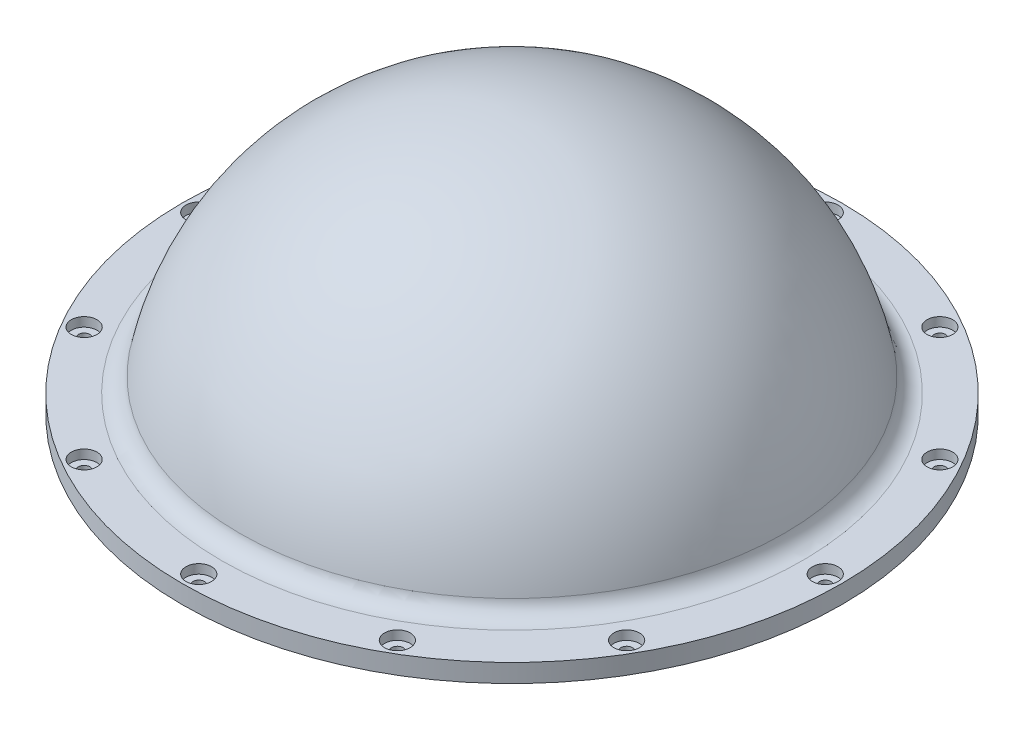
ISO-10303-21;
HEADER;
FILE_DESCRIPTION(('STEP AP214'),'2;1');
FILE_NAME('part.step','',(''),(''),'','','');
FILE_SCHEMA(('AUTOMOTIVE_DESIGN { 1 0 10303 214 1 1 1 1 }'));
ENDSEC;
DATA;
#1=APPLICATION_CONTEXT('core data for automotive mechanical design processes');
#2=APPLICATION_PROTOCOL_DEFINITION('international standard','automotive_design',2000,#1);
#3=PRODUCT_CONTEXT('',#1,'mechanical');
#4=PRODUCT('Part','Part','',(#3));
#5=PRODUCT_RELATED_PRODUCT_CATEGORY('part','',(#4));
#6=PRODUCT_DEFINITION_FORMATION('','',#4);
#7=PRODUCT_DEFINITION_CONTEXT('part definition',#1,'design');
#8=PRODUCT_DEFINITION('design','',#6,#7);
#9=PRODUCT_DEFINITION_SHAPE('','',#8);
#10=(LENGTH_UNIT() NAMED_UNIT(*) SI_UNIT(.MILLI.,.METRE.));
#11=(NAMED_UNIT(*) PLANE_ANGLE_UNIT() SI_UNIT($,.RADIAN.));
#12=(NAMED_UNIT(*) SI_UNIT($,.STERADIAN.) SOLID_ANGLE_UNIT());
#13=UNCERTAINTY_MEASURE_WITH_UNIT(LENGTH_MEASURE(1.E-05),#10,'distance_accuracy_value','');
#14=(GEOMETRIC_REPRESENTATION_CONTEXT(3) GLOBAL_UNCERTAINTY_ASSIGNED_CONTEXT((#13)) GLOBAL_UNIT_ASSIGNED_CONTEXT((#10,
#11,#12)) REPRESENTATION_CONTEXT('',''));
#15=CARTESIAN_POINT('',(0.,0.,0.));
#16=DIRECTION('',(0.,0.,1.));
#17=DIRECTION('',(1.,0.,0.));
#18=AXIS2_PLACEMENT_3D('',#15,#16,#17);
#19=CARTESIAN_POINT('',(0.,0.,0.));
#20=DIRECTION('',(0.,1.,0.));
#21=DIRECTION('',(0.,0.,1.));
#22=AXIS2_PLACEMENT_3D('',#19,#20,#21);
#23=PLANE('',#22);
#24=CARTESIAN_POINT('',(0.,0.,0.));
#25=DIRECTION('',(0.,1.,0.));
#26=DIRECTION('',(0.,0.,1.));
#27=AXIS2_PLACEMENT_3D('',#24,#25,#26);
#28=CIRCLE('',#27,79.2148975887743);
#29=CARTESIAN_POINT('',(0.,0.,79.2148975887743));
#30=VERTEX_POINT('',#29);
#31=EDGE_CURVE('E11',#30,#30,#28,.F.);
#32=ORIENTED_EDGE('',*,*,#31,.T.);
#33=EDGE_LOOP('',(#32));
#34=FACE_BOUND('',#33,.T.);
#35=CARTESIAN_POINT('',(0.,0.,0.));
#36=DIRECTION('',(0.,1.,0.));
#37=DIRECTION('',(0.,0.,1.));
#38=AXIS2_PLACEMENT_3D('',#35,#36,#37);
#39=CIRCLE('',#38,90.);
#40=CARTESIAN_POINT('',(0.,0.,90.));
#41=VERTEX_POINT('',#40);
#42=EDGE_CURVE('E132',#41,#41,#39,.T.);
#43=ORIENTED_EDGE('',*,*,#42,.T.);
#44=EDGE_LOOP('',(#43));
#45=FACE_BOUND('',#44,.T.);
#46=CARTESIAN_POINT('',(-74.0451720235685,0.,42.7499999999964));
#47=DIRECTION('',(0.,1.,0.));
#48=DIRECTION('',(0.,0.,1.));
#49=AXIS2_PLACEMENT_3D('',#46,#47,#48);
#50=CIRCLE('',#49,3.49999999999905);
#51=CARTESIAN_POINT('',(-74.0451720235685,0.,46.2499999999954));
#52=VERTEX_POINT('',#51);
#53=EDGE_CURVE('E177',#52,#52,#50,.T.);
#54=ORIENTED_EDGE('',*,*,#53,.F.);
#55=EDGE_LOOP('',(#54));
#56=FACE_BOUND('',#55,.T.);
#57=CARTESIAN_POINT('',(42.749999999998,0.,74.0451720235658));
#58=DIRECTION('',(0.,1.,0.));
#59=DIRECTION('',(0.,0.,1.));
#60=AXIS2_PLACEMENT_3D('',#57,#58,#59);
#61=CIRCLE('',#60,3.50000000000179);
#62=CARTESIAN_POINT('',(42.749999999998,0.,77.5451720235676));
#63=VERTEX_POINT('',#62);
#64=EDGE_CURVE('E258',#63,#63,#61,.T.);
#65=ORIENTED_EDGE('',*,*,#64,.F.);
#66=EDGE_LOOP('',(#65));
#67=FACE_BOUND('',#66,.T.);
#68=CARTESIAN_POINT('',(85.4999999999973,0.,-1.58509660689577E-12));
#69=DIRECTION('',(0.,1.,0.));
#70=DIRECTION('',(0.,0.,1.));
#71=AXIS2_PLACEMENT_3D('',#68,#69,#70);
#72=CIRCLE('',#71,3.50000000000258);
#73=CARTESIAN_POINT('',(85.4999999999973,0.,3.50000000000099));
#74=VERTEX_POINT('',#73);
#75=EDGE_CURVE('E265',#74,#74,#72,.T.);
#76=ORIENTED_EDGE('',*,*,#75,.F.);
#77=EDGE_LOOP('',(#76));
#78=FACE_BOUND('',#77,.T.);
#79=CARTESIAN_POINT('',(74.0451720235669,0.,42.7499999999973));
#80=DIRECTION('',(0.,1.,0.));
#81=DIRECTION('',(0.,0.,1.));
#82=AXIS2_PLACEMENT_3D('',#79,#80,#81);
#83=CIRCLE('',#82,3.50000000000244);
#84=CARTESIAN_POINT('',(74.0451720235669,0.,46.2499999999997));
#85=VERTEX_POINT('',#84);
#86=EDGE_CURVE('E274',#85,#85,#83,.T.);
#87=ORIENTED_EDGE('',*,*,#86,.F.);
#88=EDGE_LOOP('',(#87));
#89=FACE_BOUND('',#88,.T.);
#90=CARTESIAN_POINT('',(-74.045172023569,0.,-42.7500000000009));
#91=DIRECTION('',(0.,1.,0.));
#92=DIRECTION('',(0.,0.,1.));
#93=AXIS2_PLACEMENT_3D('',#90,#91,#92);
#94=CIRCLE('',#93,3.50000000000001);
#95=CARTESIAN_POINT('',(-74.045172023569,0.,-39.2500000000008));
#96=VERTEX_POINT('',#95);
#97=EDGE_CURVE('E204',#96,#96,#94,.T.);
#98=ORIENTED_EDGE('',*,*,#97,.F.);
#99=EDGE_LOOP('',(#98));
#100=FACE_BOUND('',#99,.T.);
#101=CARTESIAN_POINT('',(-1.07640985539968E-12,0.,85.4999999999958));
#102=DIRECTION('',(0.,1.,0.));
#103=DIRECTION('',(0.,0.,1.));
#104=AXIS2_PLACEMENT_3D('',#101,#102,#103);
#105=CIRCLE('',#104,3.50000000000078);
#106=CARTESIAN_POINT('',(-1.07640985539968E-12,0.,88.9999999999965));
#107=VERTEX_POINT('',#106);
#108=EDGE_CURVE('E212',#107,#107,#105,.T.);
#109=ORIENTED_EDGE('',*,*,#108,.F.);
#110=EDGE_LOOP('',(#109));
#111=FACE_BOUND('',#110,.T.);
#112=CARTESIAN_POINT('',(-42.7499999999999,0.,74.0451720235653));
#113=DIRECTION('',(0.,1.,0.));
#114=DIRECTION('',(0.,0.,1.));
#115=AXIS2_PLACEMENT_3D('',#112,#113,#114);
#116=CIRCLE('',#115,3.4999999999998);
#117=CARTESIAN_POINT('',(-42.7499999999999,0.,77.5451720235651));
#118=VERTEX_POINT('',#117);
#119=EDGE_CURVE('E186',#118,#118,#116,.T.);
#120=ORIENTED_EDGE('',*,*,#119,.F.);
#121=EDGE_LOOP('',(#120));
#122=FACE_BOUND('',#121,.T.);
#123=CARTESIAN_POINT('',(-85.4999999999984,0.,-2.65103573216274E-12));
#124=DIRECTION('',(0.,1.,0.));
#125=DIRECTION('',(0.,0.,1.));
#126=AXIS2_PLACEMENT_3D('',#123,#124,#125);
#127=CIRCLE('',#126,3.49999999999879);
#128=CARTESIAN_POINT('',(-85.4999999999984,0.,3.49999999999614));
#129=VERTEX_POINT('',#128);
#130=EDGE_CURVE('E194',#129,#129,#127,.T.);
#131=ORIENTED_EDGE('',*,*,#130,.F.);
#132=EDGE_LOOP('',(#131));
#133=FACE_BOUND('',#132,.T.);
#134=CARTESIAN_POINT('',(-42.749999999999,0.,-74.0451720235701));
#135=DIRECTION('',(0.,1.,0.));
#136=DIRECTION('',(0.,0.,1.));
#137=AXIS2_PLACEMENT_3D('',#134,#135,#136);
#138=CIRCLE('',#137,3.5);
#139=CARTESIAN_POINT('',(-42.749999999999,0.,-70.54517202357));
#140=VERTEX_POINT('',#139);
#141=EDGE_CURVE('E248',#140,#140,#138,.T.);
#142=ORIENTED_EDGE('',*,*,#141,.F.);
#143=EDGE_LOOP('',(#142));
#144=FACE_BOUND('',#143,.T.);
#145=CARTESIAN_POINT('',(0.,0.,-85.5));
#146=DIRECTION('',(0.,1.,0.));
#147=DIRECTION('',(0.,0.,1.));
#148=AXIS2_PLACEMENT_3D('',#145,#146,#147);
#149=CIRCLE('',#148,3.5);
#150=CARTESIAN_POINT('',(0.,0.,-82.));
#151=VERTEX_POINT('',#150);
#152=EDGE_CURVE('E239',#151,#151,#149,.T.);
#153=ORIENTED_EDGE('',*,*,#152,.F.);
#154=EDGE_LOOP('',(#153));
#155=FACE_BOUND('',#154,.T.);
#156=CARTESIAN_POINT('',(74.0451720235674,0.,-42.7500000000006));
#157=DIRECTION('',(0.,1.,0.));
#158=DIRECTION('',(0.,0.,1.));
#159=AXIS2_PLACEMENT_3D('',#156,#157,#158);
#160=CIRCLE('',#159,3.50000000000216);
#161=CARTESIAN_POINT('',(74.0451720235674,0.,-39.2499999999984));
#162=VERTEX_POINT('',#161);
#163=EDGE_CURVE('E230',#162,#162,#160,.T.);
#164=ORIENTED_EDGE('',*,*,#163,.F.);
#165=EDGE_LOOP('',(#164));
#166=FACE_BOUND('',#165,.T.);
#167=CARTESIAN_POINT('',(42.7500000000001,0.,-74.0451720235695));
#168=DIRECTION('',(0.,1.,0.));
#169=DIRECTION('',(0.,0.,1.));
#170=AXIS2_PLACEMENT_3D('',#167,#168,#169);
#171=CIRCLE('',#170,3.5);
#172=CARTESIAN_POINT('',(42.7500000000001,0.,-70.5451720235694));
#173=VERTEX_POINT('',#172);
#174=EDGE_CURVE('E222',#173,#173,#171,.T.);
#175=ORIENTED_EDGE('',*,*,#174,.F.);
#176=EDGE_LOOP('',(#175));
#177=FACE_BOUND('',#176,.T.);
#178=ADVANCED_FACE('F111',(#34,#45,#56,#67,#78,#89,#100,#111,#122,#133,#144,#155,#166,#177),#23,.T.);
#179=CARTESIAN_POINT('',(0.,0.,0.));
#180=DIRECTION('',(0.,1.,0.));
#181=DIRECTION('',(0.,0.,1.));
#182=AXIS2_PLACEMENT_3D('',#179,#180,#181);
#183=CIRCLE('',#182,71.5);
#184=CARTESIAN_POINT('',(0.,0.,71.5));
#185=VERTEX_POINT('',#184);
#186=EDGE_CURVE('E135',#185,#185,#183,.T.);
#187=ORIENTED_EDGE('',*,*,#186,.F.);
#188=EDGE_LOOP('',(#187));
#189=FACE_BOUND('',#188,.T.);
#190=CARTESIAN_POINT('',(0.,0.,0.));
#191=DIRECTION('',(0.,1.,0.));
#192=DIRECTION('',(0.,0.,1.));
#193=AXIS2_PLACEMENT_3D('',#190,#191,#192);
#194=CIRCLE('',#193,72.);
#195=CARTESIAN_POINT('',(0.,0.,72.));
#196=VERTEX_POINT('',#195);
#197=EDGE_CURVE('E126',#196,#196,#194,.F.);
#198=ORIENTED_EDGE('',*,*,#197,.F.);
#199=EDGE_LOOP('',(#198));
#200=FACE_BOUND('',#199,.T.);
#201=ADVANCED_FACE('F303',(#189,#200),#23,.T.);
#202=CARTESIAN_POINT('',(74.0451720235674,-9.38406204335659,-42.7500000000006));
#203=DIRECTION('',(0.,1.,0.));
#204=DIRECTION('',(0.,0.,1.));
#205=AXIS2_PLACEMENT_3D('',#202,#203,#204);
#206=CYLINDRICAL_SURFACE('',#205,1.54999999999999);
#207=CARTESIAN_POINT('',(74.0451720235674,-5.,-42.7500000000006));
#208=DIRECTION('',(0.,1.,0.));
#209=DIRECTION('',(0.,0.,1.));
#210=AXIS2_PLACEMENT_3D('',#207,#208,#209);
#211=CIRCLE('',#210,1.54999999999999);
#212=CARTESIAN_POINT('',(74.0451720235674,-5.,-41.2000000000006));
#213=VERTEX_POINT('',#212);
#214=EDGE_CURVE('E154',#213,#213,#211,.F.);
#215=ORIENTED_EDGE('',*,*,#214,.T.);
#216=EDGE_LOOP('',(#215));
#217=FACE_BOUND('',#216,.T.);
#218=CARTESIAN_POINT('',(74.0451720235674,-2.5,-42.7500000000006));
#219=DIRECTION('',(0.,1.,0.));
#220=DIRECTION('',(0.,0.,1.));
#221=AXIS2_PLACEMENT_3D('',#218,#219,#220);
#222=CIRCLE('',#221,1.54999999999999);
#223=CARTESIAN_POINT('',(74.0451720235674,-2.5,-41.2000000000006));
#224=VERTEX_POINT('',#223);
#225=EDGE_CURVE('E235',#224,#224,#222,.T.);
#226=ORIENTED_EDGE('',*,*,#225,.T.);
#227=EDGE_LOOP('',(#226));
#228=FACE_BOUND('',#227,.T.);
#229=ADVANCED_FACE('F413',(#217,#228),#206,.F.);
#230=CARTESIAN_POINT('',(42.7500000000001,-9.38406204335659,-74.0451720235695));
#231=DIRECTION('',(0.,1.,0.));
#232=DIRECTION('',(0.,0.,1.));
#233=AXIS2_PLACEMENT_3D('',#230,#231,#232);
#234=CYLINDRICAL_SURFACE('',#233,1.55);
#235=CARTESIAN_POINT('',(42.7500000000001,-5.,-74.0451720235695));
#236=DIRECTION('',(0.,1.,0.));
#237=DIRECTION('',(0.,0.,1.));
#238=AXIS2_PLACEMENT_3D('',#235,#236,#237);
#239=CIRCLE('',#238,1.55);
#240=CARTESIAN_POINT('',(42.7500000000001,-5.,-72.4951720235695));
#241=VERTEX_POINT('',#240);
#242=EDGE_CURVE('E157',#241,#241,#239,.F.);
#243=ORIENTED_EDGE('',*,*,#242,.T.);
#244=EDGE_LOOP('',(#243));
#245=FACE_BOUND('',#244,.T.);
#246=CARTESIAN_POINT('',(42.7500000000001,-2.5,-74.0451720235695));
#247=DIRECTION('',(0.,1.,0.));
#248=DIRECTION('',(0.,0.,1.));
#249=AXIS2_PLACEMENT_3D('',#246,#247,#248);
#250=CIRCLE('',#249,1.55);
#251=CARTESIAN_POINT('',(42.7500000000001,-2.5,-72.4951720235695));
#252=VERTEX_POINT('',#251);
#253=EDGE_CURVE('E225',#252,#252,#250,.T.);
#254=ORIENTED_EDGE('',*,*,#253,.T.);
#255=EDGE_LOOP('',(#254));
#256=FACE_BOUND('',#255,.T.);
#257=ADVANCED_FACE('F409',(#245,#256),#234,.F.);
#258=CARTESIAN_POINT('',(0.,-9.38406204335659,-85.5));
#259=DIRECTION('',(0.,1.,0.));
#260=DIRECTION('',(0.,0.,1.));
#261=AXIS2_PLACEMENT_3D('',#258,#259,#260);
#262=CYLINDRICAL_SURFACE('',#261,1.55);
#263=CARTESIAN_POINT('',(0.,-5.,-85.5));
#264=DIRECTION('',(0.,1.,0.));
#265=DIRECTION('',(0.,0.,1.));
#266=AXIS2_PLACEMENT_3D('',#263,#264,#265);
#267=CIRCLE('',#266,1.55);
#268=CARTESIAN_POINT('',(0.,-5.,-83.95));
#269=VERTEX_POINT('',#268);
#270=EDGE_CURVE('E161',#269,#269,#267,.F.);
#271=ORIENTED_EDGE('',*,*,#270,.T.);
#272=EDGE_LOOP('',(#271));
#273=FACE_BOUND('',#272,.T.);
#274=CARTESIAN_POINT('',(0.,-2.5,-85.5));
#275=DIRECTION('',(0.,1.,0.));
#276=DIRECTION('',(0.,0.,1.));
#277=AXIS2_PLACEMENT_3D('',#274,#275,#276);
#278=CIRCLE('',#277,1.55);
#279=CARTESIAN_POINT('',(0.,-2.5,-83.95));
#280=VERTEX_POINT('',#279);
#281=EDGE_CURVE('E244',#280,#280,#278,.T.);
#282=ORIENTED_EDGE('',*,*,#281,.T.);
#283=EDGE_LOOP('',(#282));
#284=FACE_BOUND('',#283,.T.);
#285=ADVANCED_FACE('F405',(#273,#284),#262,.F.);
#286=CARTESIAN_POINT('',(-42.749999999999,-9.38406204335659,-74.0451720235701));
#287=DIRECTION('',(0.,1.,0.));
#288=DIRECTION('',(0.,0.,1.));
#289=AXIS2_PLACEMENT_3D('',#286,#287,#288);
#290=CYLINDRICAL_SURFACE('',#289,1.55);
#291=CARTESIAN_POINT('',(-42.749999999999,-5.,-74.0451720235701));
#292=DIRECTION('',(0.,1.,0.));
#293=DIRECTION('',(0.,0.,1.));
#294=AXIS2_PLACEMENT_3D('',#291,#292,#293);
#295=CIRCLE('',#294,1.55);
#296=CARTESIAN_POINT('',(-42.749999999999,-5.,-72.4951720235701));
#297=VERTEX_POINT('',#296);
#298=EDGE_CURVE('E145',#297,#297,#295,.F.);
#299=ORIENTED_EDGE('',*,*,#298,.T.);
#300=EDGE_LOOP('',(#299));
#301=FACE_BOUND('',#300,.T.);
#302=CARTESIAN_POINT('',(-42.749999999999,-2.5,-74.0451720235701));
#303=DIRECTION('',(0.,1.,0.));
#304=DIRECTION('',(0.,0.,1.));
#305=AXIS2_PLACEMENT_3D('',#302,#303,#304);
#306=CIRCLE('',#305,1.55);
#307=CARTESIAN_POINT('',(-42.749999999999,-2.5,-72.4951720235701));
#308=VERTEX_POINT('',#307);
#309=EDGE_CURVE('E253',#308,#308,#306,.T.);
#310=ORIENTED_EDGE('',*,*,#309,.T.);
#311=EDGE_LOOP('',(#310));
#312=FACE_BOUND('',#311,.T.);
#313=ADVANCED_FACE('F401',(#301,#312),#290,.F.);
#314=CARTESIAN_POINT('',(-74.045172023569,-9.38406204335659,-42.7500000000009));
#315=DIRECTION('',(0.,1.,0.));
#316=DIRECTION('',(0.,0.,1.));
#317=AXIS2_PLACEMENT_3D('',#314,#315,#316);
#318=CYLINDRICAL_SURFACE('',#317,1.54999999999999);
#319=CARTESIAN_POINT('',(-74.045172023569,-5.,-42.7500000000009));
#320=DIRECTION('',(0.,1.,0.));
#321=DIRECTION('',(0.,0.,1.));
#322=AXIS2_PLACEMENT_3D('',#319,#320,#321);
#323=CIRCLE('',#322,1.54999999999999);
#324=CARTESIAN_POINT('',(-74.045172023569,-5.,-41.2000000000009));
#325=VERTEX_POINT('',#324);
#326=EDGE_CURVE('E141',#325,#325,#323,.F.);
#327=ORIENTED_EDGE('',*,*,#326,.T.);
#328=EDGE_LOOP('',(#327));
#329=FACE_BOUND('',#328,.T.);
#330=CARTESIAN_POINT('',(-74.045172023569,-2.5,-42.7500000000009));
#331=DIRECTION('',(0.,1.,0.));
#332=DIRECTION('',(0.,0.,1.));
#333=AXIS2_PLACEMENT_3D('',#330,#331,#332);
#334=CIRCLE('',#333,1.54999999999999);
#335=CARTESIAN_POINT('',(-74.045172023569,-2.5,-41.2000000000009));
#336=VERTEX_POINT('',#335);
#337=EDGE_CURVE('E207',#336,#336,#334,.T.);
#338=ORIENTED_EDGE('',*,*,#337,.T.);
#339=EDGE_LOOP('',(#338));
#340=FACE_BOUND('',#339,.T.);
#341=ADVANCED_FACE('F404',(#329,#340),#318,.F.);
#342=CARTESIAN_POINT('',(-85.4999999999984,-9.38406204335659,-2.65103573216274E-12));
#343=DIRECTION('',(0.,1.,0.));
#344=DIRECTION('',(0.,0.,1.));
#345=AXIS2_PLACEMENT_3D('',#342,#343,#344);
#346=CYLINDRICAL_SURFACE('',#345,1.54999999999999);
#347=CARTESIAN_POINT('',(-85.4999999999984,-5.,-2.65103573216274E-12));
#348=DIRECTION('',(0.,1.,0.));
#349=DIRECTION('',(0.,0.,1.));
#350=AXIS2_PLACEMENT_3D('',#347,#348,#349);
#351=CIRCLE('',#350,1.54999999999999);
#352=CARTESIAN_POINT('',(-85.4999999999984,-5.,1.54999999999734));
#353=VERTEX_POINT('',#352);
#354=EDGE_CURVE('E144',#353,#353,#351,.F.);
#355=ORIENTED_EDGE('',*,*,#354,.T.);
#356=EDGE_LOOP('',(#355));
#357=FACE_BOUND('',#356,.T.);
#358=CARTESIAN_POINT('',(-85.4999999999984,-2.5,-2.65103573216274E-12));
#359=DIRECTION('',(0.,1.,0.));
#360=DIRECTION('',(0.,0.,1.));
#361=AXIS2_PLACEMENT_3D('',#358,#359,#360);
#362=CIRCLE('',#361,1.54999999999999);
#363=CARTESIAN_POINT('',(-85.4999999999984,-2.5,1.54999999999734));
#364=VERTEX_POINT('',#363);
#365=EDGE_CURVE('E199',#364,#364,#362,.T.);
#366=ORIENTED_EDGE('',*,*,#365,.T.);
#367=EDGE_LOOP('',(#366));
#368=FACE_BOUND('',#367,.T.);
#369=ADVANCED_FACE('F424',(#357,#368),#346,.F.);
#370=CARTESIAN_POINT('',(-42.7499999999999,-9.38406204335659,74.0451720235653));
#371=DIRECTION('',(0.,1.,0.));
#372=DIRECTION('',(0.,0.,1.));
#373=AXIS2_PLACEMENT_3D('',#370,#371,#372);
#374=CYLINDRICAL_SURFACE('',#373,1.55);
#375=CARTESIAN_POINT('',(-42.7499999999999,-5.,74.0451720235653));
#376=DIRECTION('',(0.,1.,0.));
#377=DIRECTION('',(0.,0.,1.));
#378=AXIS2_PLACEMENT_3D('',#375,#376,#377);
#379=CIRCLE('',#378,1.55);
#380=CARTESIAN_POINT('',(-42.7499999999999,-5.,75.5951720235653));
#381=VERTEX_POINT('',#380);
#382=EDGE_CURVE('E148',#381,#381,#379,.F.);
#383=ORIENTED_EDGE('',*,*,#382,.T.);
#384=EDGE_LOOP('',(#383));
#385=FACE_BOUND('',#384,.T.);
#386=CARTESIAN_POINT('',(-42.7499999999999,-2.5,74.0451720235653));
#387=DIRECTION('',(0.,1.,0.));
#388=DIRECTION('',(0.,0.,1.));
#389=AXIS2_PLACEMENT_3D('',#386,#387,#388);
#390=CIRCLE('',#389,1.55);
#391=CARTESIAN_POINT('',(-42.7499999999999,-2.5,75.5951720235653));
#392=VERTEX_POINT('',#391);
#393=EDGE_CURVE('E189',#392,#392,#390,.T.);
#394=ORIENTED_EDGE('',*,*,#393,.T.);
#395=EDGE_LOOP('',(#394));
#396=FACE_BOUND('',#395,.T.);
#397=ADVANCED_FACE('F420',(#385,#396),#374,.F.);
#398=CARTESIAN_POINT('',(-74.0451720235685,-9.38406204335659,42.7499999999964));
#399=DIRECTION('',(0.,1.,0.));
#400=DIRECTION('',(0.,0.,1.));
#401=AXIS2_PLACEMENT_3D('',#398,#399,#400);
#402=CYLINDRICAL_SURFACE('',#401,1.54999999999999);
#403=CARTESIAN_POINT('',(-74.0451720235685,-5.,42.7499999999964));
#404=DIRECTION('',(0.,1.,0.));
#405=DIRECTION('',(0.,0.,1.));
#406=AXIS2_PLACEMENT_3D('',#403,#404,#405);
#407=CIRCLE('',#406,1.54999999999999);
#408=CARTESIAN_POINT('',(-74.0451720235685,-5.,44.2999999999964));
#409=VERTEX_POINT('',#408);
#410=EDGE_CURVE('E151',#409,#409,#407,.F.);
#411=ORIENTED_EDGE('',*,*,#410,.T.);
#412=EDGE_LOOP('',(#411));
#413=FACE_BOUND('',#412,.T.);
#414=CARTESIAN_POINT('',(-74.0451720235685,-2.5,42.7499999999964));
#415=DIRECTION('',(0.,1.,0.));
#416=DIRECTION('',(0.,0.,1.));
#417=AXIS2_PLACEMENT_3D('',#414,#415,#416);
#418=CIRCLE('',#417,1.54999999999999);
#419=CARTESIAN_POINT('',(-74.0451720235685,-2.5,44.2999999999964));
#420=VERTEX_POINT('',#419);
#421=EDGE_CURVE('E180',#420,#420,#418,.T.);
#422=ORIENTED_EDGE('',*,*,#421,.T.);
#423=EDGE_LOOP('',(#422));
#424=FACE_BOUND('',#423,.T.);
#425=ADVANCED_FACE('F393',(#413,#424),#402,.F.);
#426=CARTESIAN_POINT('',(85.4999999999973,-9.38406204335659,-1.58509660689577E-12));
#427=DIRECTION('',(0.,1.,0.));
#428=DIRECTION('',(0.,0.,1.));
#429=AXIS2_PLACEMENT_3D('',#426,#427,#428);
#430=CYLINDRICAL_SURFACE('',#429,1.54999999999999);
#431=CARTESIAN_POINT('',(85.4999999999973,-5.,-1.58509660689577E-12));
#432=DIRECTION('',(0.,1.,0.));
#433=DIRECTION('',(0.,0.,1.));
#434=AXIS2_PLACEMENT_3D('',#431,#432,#433);
#435=CIRCLE('',#434,1.54999999999999);
#436=CARTESIAN_POINT('',(85.4999999999973,-5.,1.54999999999841));
#437=VERTEX_POINT('',#436);
#438=EDGE_CURVE('E158',#437,#437,#435,.F.);
#439=ORIENTED_EDGE('',*,*,#438,.T.);
#440=EDGE_LOOP('',(#439));
#441=FACE_BOUND('',#440,.T.);
#442=CARTESIAN_POINT('',(85.4999999999973,-2.5,-1.58509660689577E-12));
#443=DIRECTION('',(0.,1.,0.));
#444=DIRECTION('',(0.,0.,1.));
#445=AXIS2_PLACEMENT_3D('',#442,#443,#444);
#446=CIRCLE('',#445,1.54999999999999);
#447=CARTESIAN_POINT('',(85.4999999999973,-2.5,1.54999999999841));
#448=VERTEX_POINT('',#447);
#449=EDGE_CURVE('E270',#448,#448,#446,.T.);
#450=ORIENTED_EDGE('',*,*,#449,.T.);
#451=EDGE_LOOP('',(#450));
#452=FACE_BOUND('',#451,.T.);
#453=ADVANCED_FACE('F390',(#441,#452),#430,.F.);
#454=CARTESIAN_POINT('',(74.0451720235669,-9.38406204335659,42.7499999999973));
#455=DIRECTION('',(0.,1.,0.));
#456=DIRECTION('',(0.,0.,1.));
#457=AXIS2_PLACEMENT_3D('',#454,#455,#456);
#458=CYLINDRICAL_SURFACE('',#457,1.54999999999999);
#459=CARTESIAN_POINT('',(74.0451720235669,-5.,42.7499999999973));
#460=DIRECTION('',(0.,1.,0.));
#461=DIRECTION('',(0.,0.,1.));
#462=AXIS2_PLACEMENT_3D('',#459,#460,#461);
#463=CIRCLE('',#462,1.54999999999999);
#464=CARTESIAN_POINT('',(74.0451720235669,-5.,44.2999999999973));
#465=VERTEX_POINT('',#464);
#466=EDGE_CURVE('E169',#465,#465,#463,.F.);
#467=ORIENTED_EDGE('',*,*,#466,.T.);
#468=EDGE_LOOP('',(#467));
#469=FACE_BOUND('',#468,.T.);
#470=CARTESIAN_POINT('',(74.0451720235669,-2.5,42.7499999999973));
#471=DIRECTION('',(0.,1.,0.));
#472=DIRECTION('',(0.,0.,1.));
#473=AXIS2_PLACEMENT_3D('',#470,#471,#472);
#474=CIRCLE('',#473,1.54999999999999);
#475=CARTESIAN_POINT('',(74.0451720235669,-2.5,44.2999999999973));
#476=VERTEX_POINT('',#475);
#477=EDGE_CURVE('E279',#476,#476,#474,.T.);
#478=ORIENTED_EDGE('',*,*,#477,.T.);
#479=EDGE_LOOP('',(#478));
#480=FACE_BOUND('',#479,.T.);
#481=ADVANCED_FACE('F285',(#469,#480),#458,.F.);
#482=CARTESIAN_POINT('',(42.749999999998,-9.38406204335659,74.0451720235658));
#483=DIRECTION('',(0.,1.,0.));
#484=DIRECTION('',(0.,0.,1.));
#485=AXIS2_PLACEMENT_3D('',#482,#483,#484);
#486=CYLINDRICAL_SURFACE('',#485,1.55);
#487=CARTESIAN_POINT('',(42.749999999998,-5.,74.0451720235658));
#488=DIRECTION('',(0.,1.,0.));
#489=DIRECTION('',(0.,0.,1.));
#490=AXIS2_PLACEMENT_3D('',#487,#488,#489);
#491=CIRCLE('',#490,1.55);
#492=CARTESIAN_POINT('',(42.749999999998,-5.,75.5951720235658));
#493=VERTEX_POINT('',#492);
#494=EDGE_CURVE('E166',#493,#493,#491,.F.);
#495=ORIENTED_EDGE('',*,*,#494,.T.);
#496=EDGE_LOOP('',(#495));
#497=FACE_BOUND('',#496,.T.);
#498=CARTESIAN_POINT('',(42.749999999998,-2.5,74.0451720235658));
#499=DIRECTION('',(0.,1.,0.));
#500=DIRECTION('',(0.,0.,1.));
#501=AXIS2_PLACEMENT_3D('',#498,#499,#500);
#502=CIRCLE('',#501,1.55);
#503=CARTESIAN_POINT('',(42.749999999998,-2.5,75.5951720235658));
#504=VERTEX_POINT('',#503);
#505=EDGE_CURVE('E261',#504,#504,#502,.T.);
#506=ORIENTED_EDGE('',*,*,#505,.T.);
#507=EDGE_LOOP('',(#506));
#508=FACE_BOUND('',#507,.T.);
#509=ADVANCED_FACE('F388',(#497,#508),#486,.F.);
#510=CARTESIAN_POINT('',(-1.07640985539968E-12,-9.38406204335659,85.4999999999958));
#511=DIRECTION('',(0.,1.,0.));
#512=DIRECTION('',(0.,0.,1.));
#513=AXIS2_PLACEMENT_3D('',#510,#511,#512);
#514=CYLINDRICAL_SURFACE('',#513,1.55);
#515=CARTESIAN_POINT('',(-1.07640985539968E-12,-5.,85.4999999999958));
#516=DIRECTION('',(0.,1.,0.));
#517=DIRECTION('',(0.,0.,1.));
#518=AXIS2_PLACEMENT_3D('',#515,#516,#517);
#519=CIRCLE('',#518,1.55);
#520=CARTESIAN_POINT('',(-1.07640985539968E-12,-5.,87.0499999999958));
#521=VERTEX_POINT('',#520);
#522=EDGE_CURVE('E138',#521,#521,#519,.F.);
#523=ORIENTED_EDGE('',*,*,#522,.T.);
#524=EDGE_LOOP('',(#523));
#525=FACE_BOUND('',#524,.T.);
#526=CARTESIAN_POINT('',(-1.07640985539968E-12,-2.5,85.4999999999958));
#527=DIRECTION('',(0.,1.,0.));
#528=DIRECTION('',(0.,0.,1.));
#529=AXIS2_PLACEMENT_3D('',#526,#527,#528);
#530=CIRCLE('',#529,1.55);
#531=CARTESIAN_POINT('',(-1.07640985539968E-12,-2.5,87.0499999999958));
#532=VERTEX_POINT('',#531);
#533=EDGE_CURVE('E217',#532,#532,#530,.T.);
#534=ORIENTED_EDGE('',*,*,#533,.T.);
#535=EDGE_LOOP('',(#534));
#536=FACE_BOUND('',#535,.T.);
#537=ADVANCED_FACE('F384',(#525,#536),#514,.F.);
#538=CARTESIAN_POINT('',(0.,-5.,0.));
#539=DIRECTION('',(0.,1.,0.));
#540=DIRECTION('',(0.,0.,1.));
#541=AXIS2_PLACEMENT_3D('',#538,#539,#540);
#542=CYLINDRICAL_SURFACE('',#541,90.);
#543=CARTESIAN_POINT('',(0.,-5.,0.));
#544=DIRECTION('',(0.,1.,0.));
#545=DIRECTION('',(0.,0.,1.));
#546=AXIS2_PLACEMENT_3D('',#543,#544,#545);
#547=CIRCLE('',#546,90.);
#548=CARTESIAN_POINT('',(0.,-5.,90.));
#549=VERTEX_POINT('',#548);
#550=EDGE_CURVE('E131',#549,#549,#547,.T.);
#551=ORIENTED_EDGE('',*,*,#550,.T.);
#552=EDGE_LOOP('',(#551));
#553=FACE_BOUND('',#552,.T.);
#554=ORIENTED_EDGE('',*,*,#42,.F.);
#555=EDGE_LOOP('',(#554));
#556=FACE_BOUND('',#555,.T.);
#557=ADVANCED_FACE('F387',(#553,#556),#542,.T.);
#558=CARTESIAN_POINT('',(0.,-5.,0.));
#559=DIRECTION('',(0.,1.,0.));
#560=DIRECTION('',(0.,0.,1.));
#561=AXIS2_PLACEMENT_3D('',#558,#559,#560);
#562=PLANE('',#561);
#563=CARTESIAN_POINT('',(0.,-5.,0.));
#564=DIRECTION('',(0.,1.,0.));
#565=DIRECTION('',(0.,0.,1.));
#566=AXIS2_PLACEMENT_3D('',#563,#564,#565);
#567=CIRCLE('',#566,76.5);
#568=CARTESIAN_POINT('',(0.,-5.,76.5));
#569=VERTEX_POINT('',#568);
#570=EDGE_CURVE('E122',#569,#569,#567,.T.);
#571=ORIENTED_EDGE('',*,*,#570,.T.);
#572=EDGE_LOOP('',(#571));
#573=FACE_BOUND('',#572,.T.);
#574=ORIENTED_EDGE('',*,*,#522,.F.);
#575=EDGE_LOOP('',(#574));
#576=FACE_BOUND('',#575,.T.);
#577=ORIENTED_EDGE('',*,*,#494,.F.);
#578=EDGE_LOOP('',(#577));
#579=FACE_BOUND('',#578,.T.);
#580=ORIENTED_EDGE('',*,*,#466,.F.);
#581=EDGE_LOOP('',(#580));
#582=FACE_BOUND('',#581,.T.);
#583=ORIENTED_EDGE('',*,*,#438,.F.);
#584=EDGE_LOOP('',(#583));
#585=FACE_BOUND('',#584,.T.);
#586=ORIENTED_EDGE('',*,*,#410,.F.);
#587=EDGE_LOOP('',(#586));
#588=FACE_BOUND('',#587,.T.);
#589=ORIENTED_EDGE('',*,*,#382,.F.);
#590=EDGE_LOOP('',(#589));
#591=FACE_BOUND('',#590,.T.);
#592=ORIENTED_EDGE('',*,*,#354,.F.);
#593=EDGE_LOOP('',(#592));
#594=FACE_BOUND('',#593,.T.);
#595=ORIENTED_EDGE('',*,*,#326,.F.);
#596=EDGE_LOOP('',(#595));
#597=FACE_BOUND('',#596,.T.);
#598=ORIENTED_EDGE('',*,*,#298,.F.);
#599=EDGE_LOOP('',(#598));
#600=FACE_BOUND('',#599,.T.);
#601=ORIENTED_EDGE('',*,*,#270,.F.);
#602=EDGE_LOOP('',(#601));
#603=FACE_BOUND('',#602,.T.);
#604=ORIENTED_EDGE('',*,*,#242,.F.);
#605=EDGE_LOOP('',(#604));
#606=FACE_BOUND('',#605,.T.);
#607=ORIENTED_EDGE('',*,*,#214,.F.);
#608=EDGE_LOOP('',(#607));
#609=FACE_BOUND('',#608,.T.);
#610=ORIENTED_EDGE('',*,*,#550,.F.);
#611=EDGE_LOOP('',(#610));
#612=FACE_BOUND('',#611,.T.);
#613=ADVANCED_FACE('F348',(#573,#576,#579,#582,#585,#588,#591,#594,#597,#600,#603,#606,#609,
#612),#562,.F.);
#614=CARTESIAN_POINT('',(-1.07640985539968E-12,-2.5,85.4999999999958));
#615=DIRECTION('',(0.,1.,0.));
#616=DIRECTION('',(0.,0.,1.));
#617=AXIS2_PLACEMENT_3D('',#614,#615,#616);
#618=CYLINDRICAL_SURFACE('',#617,3.50000000000078);
#619=CARTESIAN_POINT('',(-1.07640985539968E-12,-2.5,85.4999999999958));
#620=DIRECTION('',(0.,1.,0.));
#621=DIRECTION('',(0.,0.,1.));
#622=AXIS2_PLACEMENT_3D('',#619,#620,#621);
#623=CIRCLE('',#622,3.50000000000078);
#624=CARTESIAN_POINT('',(-1.07640985539968E-12,-2.5,88.9999999999965));
#625=VERTEX_POINT('',#624);
#626=EDGE_CURVE('E190',#625,#625,#623,.T.);
#627=ORIENTED_EDGE('',*,*,#626,.F.);
#628=EDGE_LOOP('',(#627));
#629=FACE_BOUND('',#628,.T.);
#630=ORIENTED_EDGE('',*,*,#108,.T.);
#631=EDGE_LOOP('',(#630));
#632=FACE_BOUND('',#631,.T.);
#633=ADVANCED_FACE('F344',(#629,#632),#618,.F.);
#634=CARTESIAN_POINT('',(0.,-2.5,0.));
#635=DIRECTION('',(0.,1.,0.));
#636=DIRECTION('',(0.,0.,1.));
#637=AXIS2_PLACEMENT_3D('',#634,#635,#636);
#638=PLANE('',#637);
#639=ORIENTED_EDGE('',*,*,#533,.F.);
#640=EDGE_LOOP('',(#639));
#641=FACE_BOUND('',#640,.T.);
#642=ORIENTED_EDGE('',*,*,#626,.T.);
#643=EDGE_LOOP('',(#642));
#644=FACE_BOUND('',#643,.T.);
#645=ADVANCED_FACE('F340',(#641,#644),#638,.T.);
#646=CARTESIAN_POINT('',(42.749999999998,-2.5,74.0451720235658));
#647=DIRECTION('',(0.,1.,0.));
#648=DIRECTION('',(0.,0.,1.));
#649=AXIS2_PLACEMENT_3D('',#646,#647,#648);
#650=CYLINDRICAL_SURFACE('',#649,3.50000000000179);
#651=CARTESIAN_POINT('',(42.749999999998,-2.5,74.0451720235658));
#652=DIRECTION('',(0.,1.,0.));
#653=DIRECTION('',(0.,0.,1.));
#654=AXIS2_PLACEMENT_3D('',#651,#652,#653);
#655=CIRCLE('',#654,3.50000000000179);
#656=CARTESIAN_POINT('',(42.749999999998,-2.5,77.5451720235676));
#657=VERTEX_POINT('',#656);
#658=EDGE_CURVE('E262',#657,#657,#655,.T.);
#659=ORIENTED_EDGE('',*,*,#658,.F.);
#660=EDGE_LOOP('',(#659));
#661=FACE_BOUND('',#660,.T.);
#662=ORIENTED_EDGE('',*,*,#64,.T.);
#663=EDGE_LOOP('',(#662));
#664=FACE_BOUND('',#663,.T.);
#665=ADVANCED_FACE('F343',(#661,#664),#650,.F.);
#666=CARTESIAN_POINT('',(0.,-2.5,0.));
#667=DIRECTION('',(0.,1.,0.));
#668=DIRECTION('',(0.,0.,1.));
#669=AXIS2_PLACEMENT_3D('',#666,#667,#668);
#670=PLANE('',#669);
#671=ORIENTED_EDGE('',*,*,#505,.F.);
#672=EDGE_LOOP('',(#671));
#673=FACE_BOUND('',#672,.T.);
#674=ORIENTED_EDGE('',*,*,#658,.T.);
#675=EDGE_LOOP('',(#674));
#676=FACE_BOUND('',#675,.T.);
#677=ADVANCED_FACE('F297',(#673,#676),#670,.T.);
#678=CARTESIAN_POINT('',(74.0451720235669,-2.5,42.7499999999973));
#679=DIRECTION('',(0.,1.,0.));
#680=DIRECTION('',(0.,0.,1.));
#681=AXIS2_PLACEMENT_3D('',#678,#679,#680);
#682=CYLINDRICAL_SURFACE('',#681,3.50000000000244);
#683=CARTESIAN_POINT('',(74.0451720235669,-2.5,42.7499999999973));
#684=DIRECTION('',(0.,1.,0.));
#685=DIRECTION('',(0.,0.,1.));
#686=AXIS2_PLACEMENT_3D('',#683,#684,#685);
#687=CIRCLE('',#686,3.50000000000244);
#688=CARTESIAN_POINT('',(74.0451720235669,-2.5,46.2499999999997));
#689=VERTEX_POINT('',#688);
#690=EDGE_CURVE('E226',#689,#689,#687,.T.);
#691=ORIENTED_EDGE('',*,*,#690,.F.);
#692=EDGE_LOOP('',(#691));
#693=FACE_BOUND('',#692,.T.);
#694=ORIENTED_EDGE('',*,*,#86,.T.);
#695=EDGE_LOOP('',(#694));
#696=FACE_BOUND('',#695,.T.);
#697=ADVANCED_FACE('F291',(#693,#696),#682,.F.);
#698=CARTESIAN_POINT('',(0.,-2.5,0.));
#699=DIRECTION('',(0.,1.,0.));
#700=DIRECTION('',(0.,0.,1.));
#701=AXIS2_PLACEMENT_3D('',#698,#699,#700);
#702=PLANE('',#701);
#703=ORIENTED_EDGE('',*,*,#477,.F.);
#704=EDGE_LOOP('',(#703));
#705=FACE_BOUND('',#704,.T.);
#706=ORIENTED_EDGE('',*,*,#690,.T.);
#707=EDGE_LOOP('',(#706));
#708=FACE_BOUND('',#707,.T.);
#709=ADVANCED_FACE('F287',(#705,#708),#702,.T.);
#710=CARTESIAN_POINT('',(85.4999999999973,-2.5,-1.58509660689577E-12));
#711=DIRECTION('',(0.,1.,0.));
#712=DIRECTION('',(0.,0.,1.));
#713=AXIS2_PLACEMENT_3D('',#710,#711,#712);
#714=CYLINDRICAL_SURFACE('',#713,3.50000000000258);
#715=CARTESIAN_POINT('',(85.4999999999973,-2.5,-1.58509660689577E-12));
#716=DIRECTION('',(0.,1.,0.));
#717=DIRECTION('',(0.,0.,1.));
#718=AXIS2_PLACEMENT_3D('',#715,#716,#717);
#719=CIRCLE('',#718,3.50000000000258);
#720=CARTESIAN_POINT('',(85.4999999999973,-2.5,3.50000000000099));
#721=VERTEX_POINT('',#720);
#722=EDGE_CURVE('E271',#721,#721,#719,.T.);
#723=ORIENTED_EDGE('',*,*,#722,.F.);
#724=EDGE_LOOP('',(#723));
#725=FACE_BOUND('',#724,.T.);
#726=ORIENTED_EDGE('',*,*,#75,.T.);
#727=EDGE_LOOP('',(#726));
#728=FACE_BOUND('',#727,.T.);
#729=ADVANCED_FACE('F290',(#725,#728),#714,.F.);
#730=CARTESIAN_POINT('',(0.,-2.5,0.));
#731=DIRECTION('',(0.,1.,0.));
#732=DIRECTION('',(0.,0.,1.));
#733=AXIS2_PLACEMENT_3D('',#730,#731,#732);
#734=PLANE('',#733);
#735=ORIENTED_EDGE('',*,*,#449,.F.);
#736=EDGE_LOOP('',(#735));
#737=FACE_BOUND('',#736,.T.);
#738=ORIENTED_EDGE('',*,*,#722,.T.);
#739=EDGE_LOOP('',(#738));
#740=FACE_BOUND('',#739,.T.);
#741=ADVANCED_FACE('F382',(#737,#740),#734,.T.);
#742=CARTESIAN_POINT('',(-74.0451720235685,-2.5,42.7499999999964));
#743=DIRECTION('',(0.,1.,0.));
#744=DIRECTION('',(0.,0.,1.));
#745=AXIS2_PLACEMENT_3D('',#742,#743,#744);
#746=CYLINDRICAL_SURFACE('',#745,3.49999999999905);
#747=CARTESIAN_POINT('',(-74.0451720235685,-2.5,42.7499999999964));
#748=DIRECTION('',(0.,1.,0.));
#749=DIRECTION('',(0.,0.,1.));
#750=AXIS2_PLACEMENT_3D('',#747,#748,#749);
#751=CIRCLE('',#750,3.49999999999905);
#752=CARTESIAN_POINT('',(-74.0451720235685,-2.5,46.2499999999954));
#753=VERTEX_POINT('',#752);
#754=EDGE_CURVE('E170',#753,#753,#751,.T.);
#755=ORIENTED_EDGE('',*,*,#754,.F.);
#756=EDGE_LOOP('',(#755));
#757=FACE_BOUND('',#756,.T.);
#758=ORIENTED_EDGE('',*,*,#53,.T.);
#759=EDGE_LOOP('',(#758));
#760=FACE_BOUND('',#759,.T.);
#761=ADVANCED_FACE('F378',(#757,#760),#746,.F.);
#762=CARTESIAN_POINT('',(0.,-2.5,0.));
#763=DIRECTION('',(0.,1.,0.));
#764=DIRECTION('',(0.,0.,1.));
#765=AXIS2_PLACEMENT_3D('',#762,#763,#764);
#766=PLANE('',#765);
#767=ORIENTED_EDGE('',*,*,#421,.F.);
#768=EDGE_LOOP('',(#767));
#769=FACE_BOUND('',#768,.T.);
#770=ORIENTED_EDGE('',*,*,#754,.T.);
#771=EDGE_LOOP('',(#770));
#772=FACE_BOUND('',#771,.T.);
#773=ADVANCED_FACE('F374',(#769,#772),#766,.T.);
#774=CARTESIAN_POINT('',(-42.7499999999999,-2.5,74.0451720235653));
#775=DIRECTION('',(0.,1.,0.));
#776=DIRECTION('',(0.,0.,1.));
#777=AXIS2_PLACEMENT_3D('',#774,#775,#776);
#778=CYLINDRICAL_SURFACE('',#777,3.4999999999998);
#779=CARTESIAN_POINT('',(-42.7499999999999,-2.5,74.0451720235653));
#780=DIRECTION('',(0.,1.,0.));
#781=DIRECTION('',(0.,0.,1.));
#782=AXIS2_PLACEMENT_3D('',#779,#780,#781);
#783=CIRCLE('',#782,3.4999999999998);
#784=CARTESIAN_POINT('',(-42.7499999999999,-2.5,77.5451720235651));
#785=VERTEX_POINT('',#784);
#786=EDGE_CURVE('E191',#785,#785,#783,.T.);
#787=ORIENTED_EDGE('',*,*,#786,.F.);
#788=EDGE_LOOP('',(#787));
#789=FACE_BOUND('',#788,.T.);
#790=ORIENTED_EDGE('',*,*,#119,.T.);
#791=EDGE_LOOP('',(#790));
#792=FACE_BOUND('',#791,.T.);
#793=ADVANCED_FACE('F370',(#789,#792),#778,.F.);
#794=CARTESIAN_POINT('',(0.,-2.5,0.));
#795=DIRECTION('',(0.,1.,0.));
#796=DIRECTION('',(0.,0.,1.));
#797=AXIS2_PLACEMENT_3D('',#794,#795,#796);
#798=PLANE('',#797);
#799=ORIENTED_EDGE('',*,*,#393,.F.);
#800=EDGE_LOOP('',(#799));
#801=FACE_BOUND('',#800,.T.);
#802=ORIENTED_EDGE('',*,*,#786,.T.);
#803=EDGE_LOOP('',(#802));
#804=FACE_BOUND('',#803,.T.);
#805=ADVANCED_FACE('F366',(#801,#804),#798,.T.);
#806=CARTESIAN_POINT('',(-85.4999999999984,-2.5,-2.65103573216274E-12));
#807=DIRECTION('',(0.,1.,0.));
#808=DIRECTION('',(0.,0.,1.));
#809=AXIS2_PLACEMENT_3D('',#806,#807,#808);
#810=CYLINDRICAL_SURFACE('',#809,3.49999999999879);
#811=CARTESIAN_POINT('',(-85.4999999999984,-2.5,-2.65103573216274E-12));
#812=DIRECTION('',(0.,1.,0.));
#813=DIRECTION('',(0.,0.,1.));
#814=AXIS2_PLACEMENT_3D('',#811,#812,#813);
#815=CIRCLE('',#814,3.49999999999879);
#816=CARTESIAN_POINT('',(-85.4999999999984,-2.5,3.49999999999614));
#817=VERTEX_POINT('',#816);
#818=EDGE_CURVE('E181',#817,#817,#815,.T.);
#819=ORIENTED_EDGE('',*,*,#818,.F.);
#820=EDGE_LOOP('',(#819));
#821=FACE_BOUND('',#820,.T.);
#822=ORIENTED_EDGE('',*,*,#130,.T.);
#823=EDGE_LOOP('',(#822));
#824=FACE_BOUND('',#823,.T.);
#825=ADVANCED_FACE('F362',(#821,#824),#810,.F.);
#826=CARTESIAN_POINT('',(0.,-2.5,0.));
#827=DIRECTION('',(0.,1.,0.));
#828=DIRECTION('',(0.,0.,1.));
#829=AXIS2_PLACEMENT_3D('',#826,#827,#828);
#830=PLANE('',#829);
#831=ORIENTED_EDGE('',*,*,#365,.F.);
#832=EDGE_LOOP('',(#831));
#833=FACE_BOUND('',#832,.T.);
#834=ORIENTED_EDGE('',*,*,#818,.T.);
#835=EDGE_LOOP('',(#834));
#836=FACE_BOUND('',#835,.T.);
#837=ADVANCED_FACE('F358',(#833,#836),#830,.T.);
#838=CARTESIAN_POINT('',(-74.045172023569,-2.5,-42.7500000000009));
#839=DIRECTION('',(0.,1.,0.));
#840=DIRECTION('',(0.,0.,1.));
#841=AXIS2_PLACEMENT_3D('',#838,#839,#840);
#842=CYLINDRICAL_SURFACE('',#841,3.50000000000001);
#843=CARTESIAN_POINT('',(-74.045172023569,-2.5,-42.7500000000009));
#844=DIRECTION('',(0.,1.,0.));
#845=DIRECTION('',(0.,0.,1.));
#846=AXIS2_PLACEMENT_3D('',#843,#844,#845);
#847=CIRCLE('',#846,3.50000000000001);
#848=CARTESIAN_POINT('',(-74.045172023569,-2.5,-39.2500000000008));
#849=VERTEX_POINT('',#848);
#850=EDGE_CURVE('E209',#849,#849,#847,.T.);
#851=ORIENTED_EDGE('',*,*,#850,.F.);
#852=EDGE_LOOP('',(#851));
#853=FACE_BOUND('',#852,.T.);
#854=ORIENTED_EDGE('',*,*,#97,.T.);
#855=EDGE_LOOP('',(#854));
#856=FACE_BOUND('',#855,.T.);
#857=ADVANCED_FACE('F354',(#853,#856),#842,.F.);
#858=CARTESIAN_POINT('',(0.,-2.5,0.));
#859=DIRECTION('',(0.,1.,0.));
#860=DIRECTION('',(0.,0.,1.));
#861=AXIS2_PLACEMENT_3D('',#858,#859,#860);
#862=PLANE('',#861);
#863=ORIENTED_EDGE('',*,*,#337,.F.);
#864=EDGE_LOOP('',(#863));
#865=FACE_BOUND('',#864,.T.);
#866=ORIENTED_EDGE('',*,*,#850,.T.);
#867=EDGE_LOOP('',(#866));
#868=FACE_BOUND('',#867,.T.);
#869=ADVANCED_FACE('F350',(#865,#868),#862,.T.);
#870=CARTESIAN_POINT('',(-42.749999999999,-2.5,-74.0451720235701));
#871=DIRECTION('',(0.,1.,0.));
#872=DIRECTION('',(0.,0.,1.));
#873=AXIS2_PLACEMENT_3D('',#870,#871,#872);
#874=CYLINDRICAL_SURFACE('',#873,3.5);
#875=CARTESIAN_POINT('',(-42.749999999999,-2.5,-74.0451720235701));
#876=DIRECTION('',(0.,1.,0.));
#877=DIRECTION('',(0.,0.,1.));
#878=AXIS2_PLACEMENT_3D('',#875,#876,#877);
#879=CIRCLE('',#878,3.5);
#880=CARTESIAN_POINT('',(-42.749999999999,-2.5,-70.54517202357));
#881=VERTEX_POINT('',#880);
#882=EDGE_CURVE('E208',#881,#881,#879,.T.);
#883=ORIENTED_EDGE('',*,*,#882,.F.);
#884=EDGE_LOOP('',(#883));
#885=FACE_BOUND('',#884,.T.);
#886=ORIENTED_EDGE('',*,*,#141,.T.);
#887=EDGE_LOOP('',(#886));
#888=FACE_BOUND('',#887,.T.);
#889=ADVANCED_FACE('F353',(#885,#888),#874,.F.);
#890=CARTESIAN_POINT('',(0.,-2.5,0.));
#891=DIRECTION('',(0.,1.,0.));
#892=DIRECTION('',(0.,0.,1.));
#893=AXIS2_PLACEMENT_3D('',#890,#891,#892);
#894=PLANE('',#893);
#895=ORIENTED_EDGE('',*,*,#309,.F.);
#896=EDGE_LOOP('',(#895));
#897=FACE_BOUND('',#896,.T.);
#898=ORIENTED_EDGE('',*,*,#882,.T.);
#899=EDGE_LOOP('',(#898));
#900=FACE_BOUND('',#899,.T.);
#901=ADVANCED_FACE('F503',(#897,#900),#894,.T.);
#902=CARTESIAN_POINT('',(0.,-2.5,-85.5));
#903=DIRECTION('',(0.,1.,0.));
#904=DIRECTION('',(0.,0.,1.));
#905=AXIS2_PLACEMENT_3D('',#902,#903,#904);
#906=CYLINDRICAL_SURFACE('',#905,3.5);
#907=CARTESIAN_POINT('',(0.,-2.5,-85.5));
#908=DIRECTION('',(0.,1.,0.));
#909=DIRECTION('',(0.,0.,1.));
#910=AXIS2_PLACEMENT_3D('',#907,#908,#909);
#911=CIRCLE('',#910,3.5);
#912=CARTESIAN_POINT('',(0.,-2.5,-82.));
#913=VERTEX_POINT('',#912);
#914=EDGE_CURVE('E245',#913,#913,#911,.T.);
#915=ORIENTED_EDGE('',*,*,#914,.F.);
#916=EDGE_LOOP('',(#915));
#917=FACE_BOUND('',#916,.T.);
#918=ORIENTED_EDGE('',*,*,#152,.T.);
#919=EDGE_LOOP('',(#918));
#920=FACE_BOUND('',#919,.T.);
#921=ADVANCED_FACE('F334',(#917,#920),#906,.F.);
#922=CARTESIAN_POINT('',(0.,-2.5,0.));
#923=DIRECTION('',(0.,1.,0.));
#924=DIRECTION('',(0.,0.,1.));
#925=AXIS2_PLACEMENT_3D('',#922,#923,#924);
#926=PLANE('',#925);
#927=ORIENTED_EDGE('',*,*,#281,.F.);
#928=EDGE_LOOP('',(#927));
#929=FACE_BOUND('',#928,.T.);
#930=ORIENTED_EDGE('',*,*,#914,.T.);
#931=EDGE_LOOP('',(#930));
#932=FACE_BOUND('',#931,.T.);
#933=ADVANCED_FACE('F324',(#929,#932),#926,.T.);
#934=CARTESIAN_POINT('',(42.7500000000001,-2.5,-74.0451720235695));
#935=DIRECTION('',(0.,1.,0.));
#936=DIRECTION('',(0.,0.,1.));
#937=AXIS2_PLACEMENT_3D('',#934,#935,#936);
#938=CYLINDRICAL_SURFACE('',#937,3.5);
#939=CARTESIAN_POINT('',(42.7500000000001,-2.5,-74.0451720235695));
#940=DIRECTION('',(0.,1.,0.));
#941=DIRECTION('',(0.,0.,1.));
#942=AXIS2_PLACEMENT_3D('',#939,#940,#941);
#943=CIRCLE('',#942,3.5);
#944=CARTESIAN_POINT('',(42.7500000000001,-2.5,-70.5451720235694));
#945=VERTEX_POINT('',#944);
#946=EDGE_CURVE('E227',#945,#945,#943,.T.);
#947=ORIENTED_EDGE('',*,*,#946,.F.);
#948=EDGE_LOOP('',(#947));
#949=FACE_BOUND('',#948,.T.);
#950=ORIENTED_EDGE('',*,*,#174,.T.);
#951=EDGE_LOOP('',(#950));
#952=FACE_BOUND('',#951,.T.);
#953=ADVANCED_FACE('F321',(#949,#952),#938,.F.);
#954=CARTESIAN_POINT('',(0.,-2.5,0.));
#955=DIRECTION('',(0.,1.,0.));
#956=DIRECTION('',(0.,0.,1.));
#957=AXIS2_PLACEMENT_3D('',#954,#955,#956);
#958=PLANE('',#957);
#959=ORIENTED_EDGE('',*,*,#253,.F.);
#960=EDGE_LOOP('',(#959));
#961=FACE_BOUND('',#960,.T.);
#962=ORIENTED_EDGE('',*,*,#946,.T.);
#963=EDGE_LOOP('',(#962));
#964=FACE_BOUND('',#963,.T.);
#965=ADVANCED_FACE('F323',(#961,#964),#958,.T.);
#966=CARTESIAN_POINT('',(74.0451720235674,-2.5,-42.7500000000006));
#967=DIRECTION('',(0.,1.,0.));
#968=DIRECTION('',(0.,0.,1.));
#969=AXIS2_PLACEMENT_3D('',#966,#967,#968);
#970=CYLINDRICAL_SURFACE('',#969,3.50000000000216);
#971=CARTESIAN_POINT('',(74.0451720235674,-2.5,-42.7500000000006));
#972=DIRECTION('',(0.,1.,0.));
#973=DIRECTION('',(0.,0.,1.));
#974=AXIS2_PLACEMENT_3D('',#971,#972,#973);
#975=CIRCLE('',#974,3.50000000000216);
#976=CARTESIAN_POINT('',(74.0451720235674,-2.5,-39.2499999999984));
#977=VERTEX_POINT('',#976);
#978=EDGE_CURVE('E236',#977,#977,#975,.T.);
#979=ORIENTED_EDGE('',*,*,#978,.F.);
#980=EDGE_LOOP('',(#979));
#981=FACE_BOUND('',#980,.T.);
#982=ORIENTED_EDGE('',*,*,#163,.T.);
#983=EDGE_LOOP('',(#982));
#984=FACE_BOUND('',#983,.T.);
#985=ADVANCED_FACE('F331',(#981,#984),#970,.F.);
#986=CARTESIAN_POINT('',(0.,-2.5,0.));
#987=DIRECTION('',(0.,1.,0.));
#988=DIRECTION('',(0.,0.,1.));
#989=AXIS2_PLACEMENT_3D('',#986,#987,#988);
#990=PLANE('',#989);
#991=ORIENTED_EDGE('',*,*,#225,.F.);
#992=EDGE_LOOP('',(#991));
#993=FACE_BOUND('',#992,.T.);
#994=ORIENTED_EDGE('',*,*,#978,.T.);
#995=EDGE_LOOP('',(#994));
#996=FACE_BOUND('',#995,.T.);
#997=ADVANCED_FACE('F513',(#993,#996),#990,.T.);
#998=CARTESIAN_POINT('',(0.,-10.8064516129032,0.));
#999=DIRECTION('',(0.,-1.,0.));
#1000=DIRECTION('',(-1.,0.,0.));
#1001=AXIS2_PLACEMENT_3D('',#998,#999,#1000);
#1002=SPHERICAL_SURFACE('',#1001,72.8064516129032);
#1003=ORIENTED_EDGE('',*,*,#197,.T.);
#1004=EDGE_LOOP('',(#1003));
#1005=FACE_BOUND('',#1004,.T.);
#1006=ADVANCED_FACE('F446',(#1005),#1002,.F.);
#1007=CARTESIAN_POINT('',(0.,-10.7692307692308,0.));
#1008=DIRECTION('',(0.,-1.,0.));
#1009=DIRECTION('',(1.,0.,0.));
#1010=AXIS2_PLACEMENT_3D('',#1007,#1008,#1009);
#1011=SPHERICAL_SURFACE('',#1010,75.7692307692308);
#1012=CARTESIAN_POINT('',(0.,4.02380952380952,0.));
#1013=DIRECTION('',(0.,-1.,0.));
#1014=DIRECTION('',(0.,0.,-1.));
#1015=AXIS2_PLACEMENT_3D('',#1012,#1013,#1014);
#1016=CIRCLE('',#1015,74.3111182142311);
#1017=CARTESIAN_POINT('',(0.,4.02380952380952,-74.3111182142311));
#1018=VERTEX_POINT('',#1017);
#1019=EDGE_CURVE('E118',#1018,#1018,#1016,.F.);
#1020=ORIENTED_EDGE('',*,*,#1019,.T.);
#1021=EDGE_LOOP('',(#1020));
#1022=FACE_BOUND('',#1021,.T.);
#1023=ADVANCED_FACE('F439',(#1022),#1011,.T.);
#1024=CARTESIAN_POINT('',(0.,0.,0.));
#1025=DIRECTION('',(0.,1.,0.));
#1026=DIRECTION('',(0.,0.,1.));
#1027=AXIS2_PLACEMENT_3D('',#1024,#1025,#1026);
#1028=TOROIDAL_SURFACE('',#1027,76.5,5.);
#1029=ORIENTED_EDGE('',*,*,#186,.T.);
#1030=EDGE_LOOP('',(#1029));
#1031=FACE_BOUND('',#1030,.T.);
#1032=ORIENTED_EDGE('',*,*,#570,.F.);
#1033=EDGE_LOOP('',(#1032));
#1034=FACE_BOUND('',#1033,.T.);
#1035=ADVANCED_FACE('F437',(#1031,#1034),#1028,.T.);
#1036=CARTESIAN_POINT('',(0.,5.,0.));
#1037=DIRECTION('',(0.,1.,0.));
#1038=DIRECTION('',(0.,0.,1.));
#1039=AXIS2_PLACEMENT_3D('',#1036,#1037,#1038);
#1040=TOROIDAL_SURFACE('',#1039,79.2148975887743,5.);
#1041=ORIENTED_EDGE('',*,*,#31,.F.);
#1042=EDGE_LOOP('',(#1041));
#1043=FACE_BOUND('',#1042,.T.);
#1044=ORIENTED_EDGE('',*,*,#1019,.F.);
#1045=EDGE_LOOP('',(#1044));
#1046=FACE_BOUND('',#1045,.T.);
#1047=ADVANCED_FACE('F113',(#1043,#1046),#1040,.F.);
#1048=CLOSED_SHELL('',(#178,#201,#229,#257,#285,#313,#341,#369,#397,#425,#453,#481,#509,#537,
#557,#613,#633,#645,#665,#677,#697,#709,#729,#741,#761,#773,#793,#805,#825,#837,#857,#869,#889,
#901,#921,#933,#953,#965,#985,#997,#1006,#1023,#1035,#1047));
#1049=MANIFOLD_SOLID_BREP('B2',#1048);
#1050=ADVANCED_BREP_SHAPE_REPRESENTATION('',(#18,#1049),#14);
#1051=SHAPE_DEFINITION_REPRESENTATION(#9,#1050);
ENDSEC;
END-ISO-10303-21;
